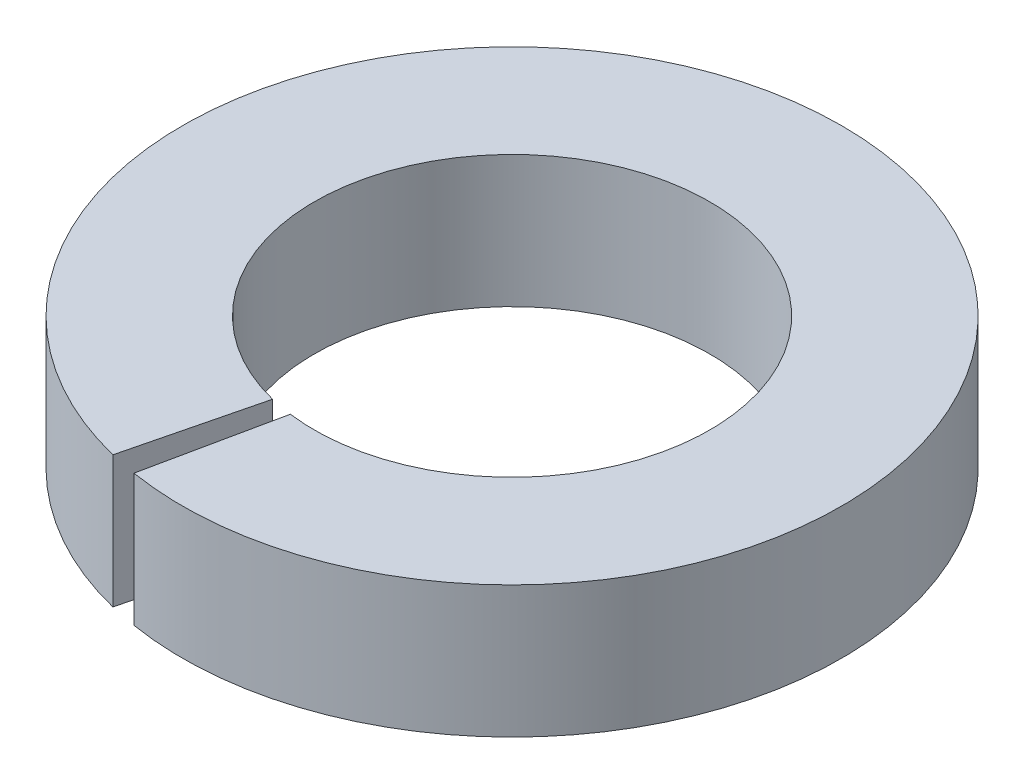
ISO-10303-21;
HEADER;
FILE_DESCRIPTION(('STEP AP214'),'2;1');
FILE_NAME('part.step','',(''),(''),'','','');
FILE_SCHEMA(('AUTOMOTIVE_DESIGN { 1 0 10303 214 1 1 1 1 }'));
ENDSEC;
DATA;
#1=APPLICATION_CONTEXT('core data for automotive mechanical design processes');
#2=APPLICATION_PROTOCOL_DEFINITION('international standard','automotive_design',2000,#1);
#3=PRODUCT_CONTEXT('',#1,'mechanical');
#4=PRODUCT('Part','Part','',(#3));
#5=PRODUCT_RELATED_PRODUCT_CATEGORY('part','',(#4));
#6=PRODUCT_DEFINITION_FORMATION('','',#4);
#7=PRODUCT_DEFINITION_CONTEXT('part definition',#1,'design');
#8=PRODUCT_DEFINITION('design','',#6,#7);
#9=PRODUCT_DEFINITION_SHAPE('','',#8);
#10=(LENGTH_UNIT() NAMED_UNIT(*) SI_UNIT(.MILLI.,.METRE.));
#11=(NAMED_UNIT(*) PLANE_ANGLE_UNIT() SI_UNIT($,.RADIAN.));
#12=(NAMED_UNIT(*) SI_UNIT($,.STERADIAN.) SOLID_ANGLE_UNIT());
#13=UNCERTAINTY_MEASURE_WITH_UNIT(LENGTH_MEASURE(1.E-05),#10,'distance_accuracy_value','');
#14=(GEOMETRIC_REPRESENTATION_CONTEXT(3) GLOBAL_UNCERTAINTY_ASSIGNED_CONTEXT((#13)) GLOBAL_UNIT_ASSIGNED_CONTEXT((#10,
#11,#12)) REPRESENTATION_CONTEXT('',''));
#15=CARTESIAN_POINT('',(0.,0.,0.));
#16=DIRECTION('',(0.,0.,1.));
#17=DIRECTION('',(1.,0.,0.));
#18=AXIS2_PLACEMENT_3D('',#15,#16,#17);
#19=CARTESIAN_POINT('',(0.,1.,0.));
#20=DIRECTION('',(0.,-1.,0.));
#21=DIRECTION('',(0.,0.,-1.));
#22=AXIS2_PLACEMENT_3D('',#19,#20,#21);
#23=CYLINDRICAL_SURFACE('',#22,1.5);
#24=CARTESIAN_POINT('',(0.,0.,0.));
#25=DIRECTION('',(0.,-1.,0.));
#26=DIRECTION('',(0.,0.,1.));
#27=AXIS2_PLACEMENT_3D('',#24,#25,#26);
#28=CIRCLE('',#27,1.5);
#29=CARTESIAN_POINT('',(-0.360733903933664,0.,1.45597769576075));
#30=VERTEX_POINT('',#29);
#31=CARTESIAN_POINT('',(-0.194846130923795,0.,1.48729115685666));
#32=VERTEX_POINT('',#31);
#33=EDGE_CURVE('E98',#30,#32,#28,.T.);
#34=ORIENTED_EDGE('',*,*,#33,.T.);
#35=DIRECTION('',(0.,-1.,0.));
#36=VECTOR('',#35,1.);
#37=CARTESIAN_POINT('',(-0.194846130923795,1.,1.48729115685666));
#38=LINE('',#37,#36);
#39=CARTESIAN_POINT('',(-0.194846130923795,1.,1.48729115685666));
#40=VERTEX_POINT('',#39);
#41=EDGE_CURVE('E11',#40,#32,#38,.T.);
#42=ORIENTED_EDGE('',*,*,#41,.F.);
#43=CARTESIAN_POINT('',(0.,1.,0.));
#44=DIRECTION('',(0.,-1.,0.));
#45=DIRECTION('',(0.,0.,1.));
#46=AXIS2_PLACEMENT_3D('',#43,#44,#45);
#47=CIRCLE('',#46,1.5);
#48=CARTESIAN_POINT('',(-0.360733903933664,1.,1.45597769576075));
#49=VERTEX_POINT('',#48);
#50=EDGE_CURVE('E86',#49,#40,#47,.T.);
#51=ORIENTED_EDGE('',*,*,#50,.F.);
#52=DIRECTION('',(0.,-1.,0.));
#53=VECTOR('',#52,1.);
#54=CARTESIAN_POINT('',(-0.360733903933664,1.,1.45597769576075));
#55=LINE('',#54,#53);
#56=EDGE_CURVE('E94',#49,#30,#55,.T.);
#57=ORIENTED_EDGE('',*,*,#56,.T.);
#58=EDGE_LOOP('',(#34,#42,#51,#57));
#59=FACE_BOUND('',#58,.T.);
#60=ADVANCED_FACE('F35',(#59),#23,.F.);
#61=CARTESIAN_POINT('',(-0.400815448815184,1.,2.46766022296245));
#62=DIRECTION('',(0.978635058761231,0.,0.205605013954918));
#63=DIRECTION('',(0.205605013954918,0.,-0.978635058761231));
#64=AXIS2_PLACEMENT_3D('',#61,#62,#63);
#65=PLANE('',#64);
#66=DIRECTION('',(-0.205605013954918,0.,0.978635058761231));
#67=VECTOR('',#66,1.);
#68=CARTESIAN_POINT('',(-0.400815448815184,0.,2.46766022296245));
#69=LINE('',#68,#67);
#70=CARTESIAN_POINT('',(-0.400815448815184,0.,2.46766022296245));
#71=VERTEX_POINT('',#70);
#72=EDGE_CURVE('E90',#32,#71,#69,.T.);
#73=ORIENTED_EDGE('',*,*,#72,.T.);
#74=DIRECTION('',(0.,-1.,0.));
#75=VECTOR('',#74,1.);
#76=CARTESIAN_POINT('',(-0.400815448815184,1.,2.46766022296245));
#77=LINE('',#76,#75);
#78=CARTESIAN_POINT('',(-0.400815448815184,1.,2.46766022296245));
#79=VERTEX_POINT('',#78);
#80=EDGE_CURVE('E43',#79,#71,#77,.T.);
#81=ORIENTED_EDGE('',*,*,#80,.F.);
#82=DIRECTION('',(-0.205605013954918,0.,0.978635058761231));
#83=VECTOR('',#82,1.);
#84=CARTESIAN_POINT('',(-0.400815448815184,1.,2.46766022296245));
#85=LINE('',#84,#83);
#86=EDGE_CURVE('E81',#40,#79,#85,.T.);
#87=ORIENTED_EDGE('',*,*,#86,.F.);
#88=ORIENTED_EDGE('',*,*,#41,.T.);
#89=EDGE_LOOP('',(#73,#81,#87,#88));
#90=FACE_BOUND('',#89,.T.);
#91=ADVANCED_FACE('F89',(#90),#65,.F.);
#92=CARTESIAN_POINT('',(0.,1.,0.));
#93=DIRECTION('',(0.,-1.,0.));
#94=DIRECTION('',(0.,0.,-1.));
#95=AXIS2_PLACEMENT_3D('',#92,#93,#94);
#96=CYLINDRICAL_SURFACE('',#95,2.5);
#97=CARTESIAN_POINT('',(0.,0.,0.));
#98=DIRECTION('',(0.,1.,0.));
#99=DIRECTION('',(0.,0.,1.));
#100=AXIS2_PLACEMENT_3D('',#97,#98,#99);
#101=CIRCLE('',#100,2.5);
#102=CARTESIAN_POINT('',(-0.601223173222777,0.,2.42662949293458));
#103=VERTEX_POINT('',#102);
#104=EDGE_CURVE('E68',#71,#103,#101,.T.);
#105=ORIENTED_EDGE('',*,*,#104,.T.);
#106=DIRECTION('',(0.,-1.,0.));
#107=VECTOR('',#106,1.);
#108=CARTESIAN_POINT('',(-0.601223173222777,1.,2.42662949293458));
#109=LINE('',#108,#107);
#110=CARTESIAN_POINT('',(-0.601223173222777,1.,2.42662949293458));
#111=VERTEX_POINT('',#110);
#112=EDGE_CURVE('E91',#111,#103,#109,.T.);
#113=ORIENTED_EDGE('',*,*,#112,.F.);
#114=CARTESIAN_POINT('',(0.,1.,0.));
#115=DIRECTION('',(0.,1.,0.));
#116=DIRECTION('',(0.,0.,1.));
#117=AXIS2_PLACEMENT_3D('',#114,#115,#116);
#118=CIRCLE('',#117,2.5);
#119=EDGE_CURVE('E84',#79,#111,#118,.T.);
#120=ORIENTED_EDGE('',*,*,#119,.F.);
#121=ORIENTED_EDGE('',*,*,#80,.T.);
#122=EDGE_LOOP('',(#105,#113,#120,#121));
#123=FACE_BOUND('',#122,.T.);
#124=ADVANCED_FACE('F92',(#123),#96,.T.);
#125=CARTESIAN_POINT('',(-0.360733903933664,1.,1.45597769576075));
#126=DIRECTION('',(-0.970651797173831,0.,-0.240489269289113));
#127=DIRECTION('',(-0.240489269289113,0.,0.970651797173832));
#128=AXIS2_PLACEMENT_3D('',#125,#126,#127);
#129=PLANE('',#128);
#130=DIRECTION('',(0.240489269289113,0.,-0.970651797173831));
#131=VECTOR('',#130,1.);
#132=CARTESIAN_POINT('',(-0.360733903933664,0.,1.45597769576075));
#133=LINE('',#132,#131);
#134=EDGE_CURVE('E74',#103,#30,#133,.T.);
#135=ORIENTED_EDGE('',*,*,#134,.T.);
#136=ORIENTED_EDGE('',*,*,#56,.F.);
#137=DIRECTION('',(0.240489269289113,0.,-0.970651797173831));
#138=VECTOR('',#137,1.);
#139=CARTESIAN_POINT('',(-0.360733903933664,1.,1.45597769576075));
#140=LINE('',#139,#138);
#141=EDGE_CURVE('E51',#111,#49,#140,.T.);
#142=ORIENTED_EDGE('',*,*,#141,.F.);
#143=ORIENTED_EDGE('',*,*,#112,.T.);
#144=EDGE_LOOP('',(#135,#136,#142,#143));
#145=FACE_BOUND('',#144,.T.);
#146=ADVANCED_FACE('F105',(#145),#129,.F.);
#147=CARTESIAN_POINT('',(0.,1.,0.));
#148=DIRECTION('',(0.,1.,0.));
#149=DIRECTION('',(0.,0.,1.));
#150=AXIS2_PLACEMENT_3D('',#147,#148,#149);
#151=PLANE('',#150);
#152=ORIENTED_EDGE('',*,*,#50,.T.);
#153=ORIENTED_EDGE('',*,*,#86,.T.);
#154=ORIENTED_EDGE('',*,*,#119,.T.);
#155=ORIENTED_EDGE('',*,*,#141,.T.);
#156=EDGE_LOOP('',(#152,#153,#154,#155));
#157=FACE_BOUND('',#156,.T.);
#158=ADVANCED_FACE('F82',(#157),#151,.T.);
#159=CARTESIAN_POINT('',(0.,0.,0.));
#160=DIRECTION('',(0.,1.,0.));
#161=DIRECTION('',(0.,0.,1.));
#162=AXIS2_PLACEMENT_3D('',#159,#160,#161);
#163=PLANE('',#162);
#164=ORIENTED_EDGE('',*,*,#33,.F.);
#165=ORIENTED_EDGE('',*,*,#134,.F.);
#166=ORIENTED_EDGE('',*,*,#104,.F.);
#167=ORIENTED_EDGE('',*,*,#72,.F.);
#168=EDGE_LOOP('',(#164,#165,#166,#167));
#169=FACE_BOUND('',#168,.T.);
#170=ADVANCED_FACE('F108',(#169),#163,.F.);
#171=CLOSED_SHELL('',(#60,#91,#124,#146,#158,#170));
#172=MANIFOLD_SOLID_BREP('B2',#171);
#173=ADVANCED_BREP_SHAPE_REPRESENTATION('',(#18,#172),#14);
#174=SHAPE_DEFINITION_REPRESENTATION(#9,#173);
ENDSEC;
END-ISO-10303-21;
